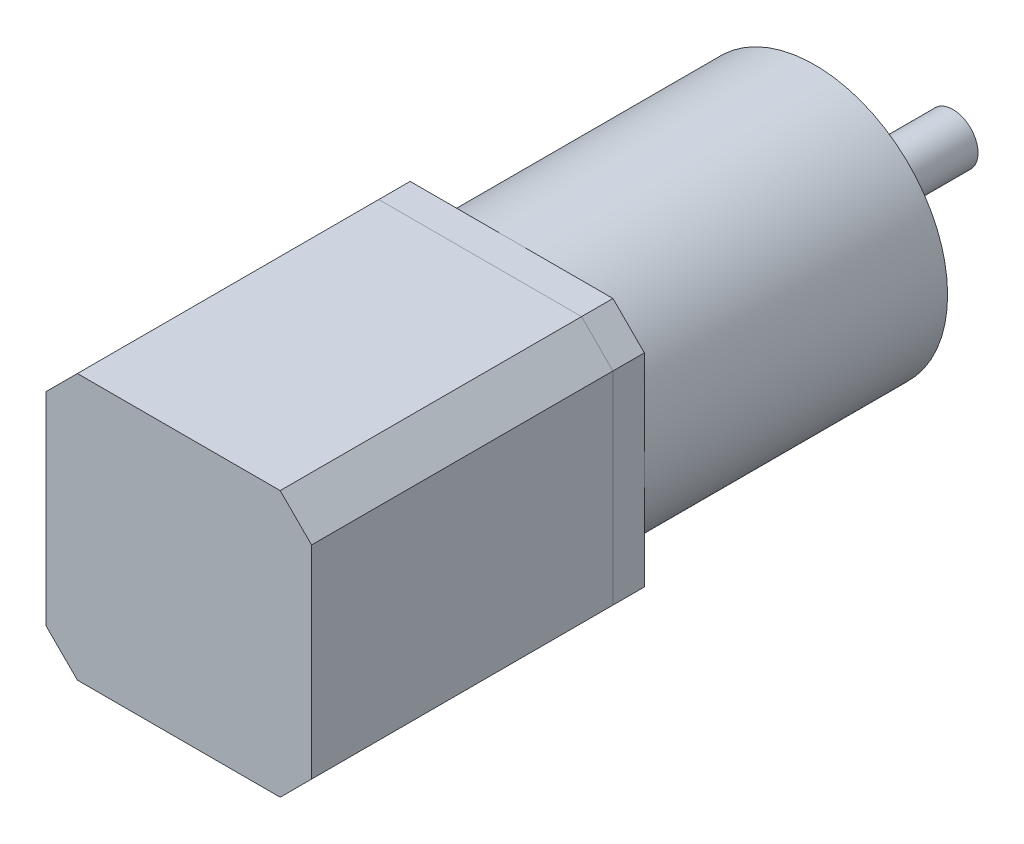
ISO-10303-21;
HEADER;
FILE_DESCRIPTION(('STEP AP214'),'2;1');
FILE_NAME('part.step','',(''),(''),'','','');
FILE_SCHEMA(('AUTOMOTIVE_DESIGN { 1 0 10303 214 1 1 1 1 }'));
ENDSEC;
DATA;
#1=APPLICATION_CONTEXT('core data for automotive mechanical design processes');
#2=APPLICATION_PROTOCOL_DEFINITION('international standard','automotive_design',2000,#1);
#3=PRODUCT_CONTEXT('',#1,'mechanical');
#4=PRODUCT('Part','Part','',(#3));
#5=PRODUCT_RELATED_PRODUCT_CATEGORY('part','',(#4));
#6=PRODUCT_DEFINITION_FORMATION('','',#4);
#7=PRODUCT_DEFINITION_CONTEXT('part definition',#1,'design');
#8=PRODUCT_DEFINITION('design','',#6,#7);
#9=PRODUCT_DEFINITION_SHAPE('','',#8);
#10=(LENGTH_UNIT() NAMED_UNIT(*) SI_UNIT(.MILLI.,.METRE.));
#11=(NAMED_UNIT(*) PLANE_ANGLE_UNIT() SI_UNIT($,.RADIAN.));
#12=(NAMED_UNIT(*) SI_UNIT($,.STERADIAN.) SOLID_ANGLE_UNIT());
#13=UNCERTAINTY_MEASURE_WITH_UNIT(LENGTH_MEASURE(1.E-05),#10,'distance_accuracy_value','');
#14=(GEOMETRIC_REPRESENTATION_CONTEXT(3) GLOBAL_UNCERTAINTY_ASSIGNED_CONTEXT((#13)) GLOBAL_UNIT_ASSIGNED_CONTEXT((#10,
#11,#12)) REPRESENTATION_CONTEXT('',''));
#15=CARTESIAN_POINT('',(0.,0.,0.));
#16=DIRECTION('',(0.,0.,1.));
#17=DIRECTION('',(1.,0.,0.));
#18=AXIS2_PLACEMENT_3D('',#15,#16,#17);
#19=CARTESIAN_POINT('',(0.,0.,-55.8));
#20=DIRECTION('',(0.,0.,1.));
#21=DIRECTION('',(1.,0.,0.));
#22=AXIS2_PLACEMENT_3D('',#19,#20,#21);
#23=CYLINDRICAL_SURFACE('',#22,6.21097509165244);
#24=CARTESIAN_POINT('',(0.,0.,-55.8));
#25=DIRECTION('',(0.,0.,-1.));
#26=DIRECTION('',(-1.,0.,0.));
#27=AXIS2_PLACEMENT_3D('',#24,#25,#26);
#28=CIRCLE('',#27,6.21097509165244);
#29=CARTESIAN_POINT('',(-6.21097509165244,0.,-55.8));
#30=VERTEX_POINT('',#29);
#31=EDGE_CURVE('E11',#30,#30,#28,.T.);
#32=ORIENTED_EDGE('',*,*,#31,.F.);
#33=EDGE_LOOP('',(#32));
#34=FACE_BOUND('',#33,.T.);
#35=CARTESIAN_POINT('',(0.,0.,-55.3));
#36=DIRECTION('',(0.,0.,-1.));
#37=DIRECTION('',(-1.,0.,0.));
#38=AXIS2_PLACEMENT_3D('',#35,#36,#37);
#39=CIRCLE('',#38,6.21097509165244);
#40=CARTESIAN_POINT('',(-6.21097509165244,0.,-55.3));
#41=VERTEX_POINT('',#40);
#42=EDGE_CURVE('E44',#41,#41,#39,.T.);
#43=ORIENTED_EDGE('',*,*,#42,.T.);
#44=EDGE_LOOP('',(#43));
#45=FACE_BOUND('',#44,.T.);
#46=ADVANCED_FACE('F41',(#34,#45),#23,.T.);
#47=CARTESIAN_POINT('',(0.,0.,-55.8));
#48=DIRECTION('',(0.,0.,-1.));
#49=DIRECTION('',(-1.,0.,0.));
#50=AXIS2_PLACEMENT_3D('',#47,#48,#49);
#51=PLANE('',#50);
#52=ORIENTED_EDGE('',*,*,#31,.T.);
#53=EDGE_LOOP('',(#52));
#54=FACE_BOUND('',#53,.T.);
#55=ADVANCED_FACE('F56',(#54),#51,.T.);
#56=CARTESIAN_POINT('',(0.,0.,-55.3));
#57=DIRECTION('',(0.,0.,-1.));
#58=DIRECTION('',(-1.,0.,0.));
#59=AXIS2_PLACEMENT_3D('',#56,#57,#58);
#60=PLANE('',#59);
#61=ORIENTED_EDGE('',*,*,#42,.F.);
#62=EDGE_LOOP('',(#61));
#63=FACE_BOUND('',#62,.T.);
#64=ADVANCED_FACE('F54',(#63),#60,.F.);
#65=CLOSED_SHELL('',(#46,#55,#64));
#66=MANIFOLD_SOLID_BREP('B2',#65);
#67=CARTESIAN_POINT('',(0.,0.,-75.3));
#68=DIRECTION('',(0.,0.,1.));
#69=DIRECTION('',(1.,0.,0.));
#70=AXIS2_PLACEMENT_3D('',#67,#68,#69);
#71=CYLINDRICAL_SURFACE('',#70,4.);
#72=CARTESIAN_POINT('',(0.,0.,-75.3));
#73=DIRECTION('',(0.,0.,-1.));
#74=DIRECTION('',(-1.,0.,0.));
#75=AXIS2_PLACEMENT_3D('',#72,#73,#74);
#76=CIRCLE('',#75,4.);
#77=CARTESIAN_POINT('',(-4.,0.,-75.3));
#78=VERTEX_POINT('',#77);
#79=EDGE_CURVE('E40',#78,#78,#76,.T.);
#80=ORIENTED_EDGE('',*,*,#79,.F.);
#81=EDGE_LOOP('',(#80));
#82=FACE_BOUND('',#81,.T.);
#83=CARTESIAN_POINT('',(0.,0.,-55.3));
#84=DIRECTION('',(0.,0.,-1.));
#85=DIRECTION('',(-1.,0.,0.));
#86=AXIS2_PLACEMENT_3D('',#83,#84,#85);
#87=CIRCLE('',#86,4.);
#88=CARTESIAN_POINT('',(-4.,0.,-55.3));
#89=VERTEX_POINT('',#88);
#90=EDGE_CURVE('E92',#89,#89,#87,.T.);
#91=ORIENTED_EDGE('',*,*,#90,.T.);
#92=EDGE_LOOP('',(#91));
#93=FACE_BOUND('',#92,.T.);
#94=ADVANCED_FACE('F89',(#82,#93),#71,.T.);
#95=CARTESIAN_POINT('',(0.,0.,-75.3));
#96=DIRECTION('',(0.,0.,-1.));
#97=DIRECTION('',(-1.,0.,0.));
#98=AXIS2_PLACEMENT_3D('',#95,#96,#97);
#99=PLANE('',#98);
#100=ORIENTED_EDGE('',*,*,#79,.T.);
#101=EDGE_LOOP('',(#100));
#102=FACE_BOUND('',#101,.T.);
#103=ADVANCED_FACE('F104',(#102),#99,.T.);
#104=CARTESIAN_POINT('',(0.,0.,-55.3));
#105=DIRECTION('',(0.,0.,-1.));
#106=DIRECTION('',(-1.,0.,0.));
#107=AXIS2_PLACEMENT_3D('',#104,#105,#106);
#108=PLANE('',#107);
#109=ORIENTED_EDGE('',*,*,#90,.F.);
#110=EDGE_LOOP('',(#109));
#111=FACE_BOUND('',#110,.T.);
#112=ADVANCED_FACE('F102',(#111),#108,.F.);
#113=CLOSED_SHELL('',(#94,#103,#112));
#114=MANIFOLD_SOLID_BREP('B6',#113);
#115=CARTESIAN_POINT('',(0.,0.,-55.3));
#116=DIRECTION('',(0.,0.,1.));
#117=DIRECTION('',(1.,0.,0.));
#118=AXIS2_PLACEMENT_3D('',#115,#116,#117);
#119=CYLINDRICAL_SURFACE('',#118,11.);
#120=CARTESIAN_POINT('',(0.,0.,-55.3));
#121=DIRECTION('',(0.,0.,-1.));
#122=DIRECTION('',(-1.,0.,0.));
#123=AXIS2_PLACEMENT_3D('',#120,#121,#122);
#124=CIRCLE('',#123,11.);
#125=CARTESIAN_POINT('',(-11.,0.,-55.3));
#126=VERTEX_POINT('',#125);
#127=EDGE_CURVE('E88',#126,#126,#124,.T.);
#128=ORIENTED_EDGE('',*,*,#127,.F.);
#129=EDGE_LOOP('',(#128));
#130=FACE_BOUND('',#129,.T.);
#131=CARTESIAN_POINT('',(0.,0.,-53.3));
#132=DIRECTION('',(0.,0.,-1.));
#133=DIRECTION('',(-1.,0.,0.));
#134=AXIS2_PLACEMENT_3D('',#131,#132,#133);
#135=CIRCLE('',#134,11.);
#136=CARTESIAN_POINT('',(-11.,0.,-53.3));
#137=VERTEX_POINT('',#136);
#138=EDGE_CURVE('E140',#137,#137,#135,.T.);
#139=ORIENTED_EDGE('',*,*,#138,.T.);
#140=EDGE_LOOP('',(#139));
#141=FACE_BOUND('',#140,.T.);
#142=ADVANCED_FACE('F137',(#130,#141),#119,.T.);
#143=CARTESIAN_POINT('',(0.,0.,-55.3));
#144=DIRECTION('',(0.,0.,-1.));
#145=DIRECTION('',(-1.,0.,0.));
#146=AXIS2_PLACEMENT_3D('',#143,#144,#145);
#147=PLANE('',#146);
#148=ORIENTED_EDGE('',*,*,#127,.T.);
#149=EDGE_LOOP('',(#148));
#150=FACE_BOUND('',#149,.T.);
#151=ADVANCED_FACE('F152',(#150),#147,.T.);
#152=CARTESIAN_POINT('',(0.,0.,-53.3));
#153=DIRECTION('',(0.,0.,-1.));
#154=DIRECTION('',(-1.,0.,0.));
#155=AXIS2_PLACEMENT_3D('',#152,#153,#154);
#156=PLANE('',#155);
#157=ORIENTED_EDGE('',*,*,#138,.F.);
#158=EDGE_LOOP('',(#157));
#159=FACE_BOUND('',#158,.T.);
#160=ADVANCED_FACE('F150',(#159),#156,.F.);
#161=CLOSED_SHELL('',(#142,#151,#160));
#162=MANIFOLD_SOLID_BREP('B35',#161);
#163=CARTESIAN_POINT('',(0.,0.,-53.3));
#164=DIRECTION('',(0.,0.,1.));
#165=DIRECTION('',(1.,0.,0.));
#166=AXIS2_PLACEMENT_3D('',#163,#164,#165);
#167=CYLINDRICAL_SURFACE('',#166,21.15);
#168=CARTESIAN_POINT('',(0.,0.,-53.3));
#169=DIRECTION('',(0.,0.,-1.));
#170=DIRECTION('',(-1.,0.,0.));
#171=AXIS2_PLACEMENT_3D('',#168,#169,#170);
#172=CIRCLE('',#171,21.15);
#173=CARTESIAN_POINT('',(-21.15,0.,-53.3));
#174=VERTEX_POINT('',#173);
#175=EDGE_CURVE('E136',#174,#174,#172,.T.);
#176=ORIENTED_EDGE('',*,*,#175,.F.);
#177=EDGE_LOOP('',(#176));
#178=FACE_BOUND('',#177,.T.);
#179=CARTESIAN_POINT('',(0.,0.,-5.));
#180=DIRECTION('',(0.,0.,-1.));
#181=DIRECTION('',(-1.,0.,0.));
#182=AXIS2_PLACEMENT_3D('',#179,#180,#181);
#183=CIRCLE('',#182,21.15);
#184=CARTESIAN_POINT('',(-21.15,0.,-5.));
#185=VERTEX_POINT('',#184);
#186=EDGE_CURVE('E190',#185,#185,#183,.T.);
#187=ORIENTED_EDGE('',*,*,#186,.T.);
#188=EDGE_LOOP('',(#187));
#189=FACE_BOUND('',#188,.T.);
#190=ADVANCED_FACE('F187',(#178,#189),#167,.T.);
#191=CARTESIAN_POINT('',(0.,0.,-53.3));
#192=DIRECTION('',(0.,0.,-1.));
#193=DIRECTION('',(-1.,0.,0.));
#194=AXIS2_PLACEMENT_3D('',#191,#192,#193);
#195=PLANE('',#194);
#196=CARTESIAN_POINT('',(17.5,0.,-53.3));
#197=DIRECTION('',(0.,0.,-1.));
#198=DIRECTION('',(-1.,0.,0.));
#199=AXIS2_PLACEMENT_3D('',#196,#197,#198);
#200=CIRCLE('',#199,1.5);
#201=CARTESIAN_POINT('',(16.,0.,-53.3));
#202=VERTEX_POINT('',#201);
#203=EDGE_CURVE('E217',#202,#202,#200,.T.);
#204=ORIENTED_EDGE('',*,*,#203,.F.);
#205=EDGE_LOOP('',(#204));
#206=FACE_BOUND('',#205,.T.);
#207=CARTESIAN_POINT('',(0.,17.5,-53.3));
#208=DIRECTION('',(0.,0.,-1.));
#209=DIRECTION('',(-1.,0.,0.));
#210=AXIS2_PLACEMENT_3D('',#207,#208,#209);
#211=CIRCLE('',#210,1.5);
#212=CARTESIAN_POINT('',(-1.50000000000006,17.5,-53.3));
#213=VERTEX_POINT('',#212);
#214=EDGE_CURVE('E211',#213,#213,#211,.T.);
#215=ORIENTED_EDGE('',*,*,#214,.F.);
#216=EDGE_LOOP('',(#215));
#217=FACE_BOUND('',#216,.T.);
#218=CARTESIAN_POINT('',(-17.5,-1.2220184685951E-13,-53.3));
#219=DIRECTION('',(0.,0.,-1.));
#220=DIRECTION('',(-1.,0.,0.));
#221=AXIS2_PLACEMENT_3D('',#218,#219,#220);
#222=CIRCLE('',#221,1.5);
#223=CARTESIAN_POINT('',(-19.,-1.2220184685951E-13,-53.3));
#224=VERTEX_POINT('',#223);
#225=EDGE_CURVE('E205',#224,#224,#222,.T.);
#226=ORIENTED_EDGE('',*,*,#225,.F.);
#227=EDGE_LOOP('',(#226));
#228=FACE_BOUND('',#227,.T.);
#229=CARTESIAN_POINT('',(1.83302770289265E-13,-17.5,-53.3));
#230=DIRECTION('',(0.,0.,-1.));
#231=DIRECTION('',(-1.,0.,0.));
#232=AXIS2_PLACEMENT_3D('',#229,#230,#231);
#233=CIRCLE('',#232,1.5);
#234=CARTESIAN_POINT('',(-1.49999999999982,-17.5,-53.3));
#235=VERTEX_POINT('',#234);
#236=EDGE_CURVE('E199',#235,#235,#233,.T.);
#237=ORIENTED_EDGE('',*,*,#236,.F.);
#238=EDGE_LOOP('',(#237));
#239=FACE_BOUND('',#238,.T.);
#240=ORIENTED_EDGE('',*,*,#175,.T.);
#241=EDGE_LOOP('',(#240));
#242=FACE_BOUND('',#241,.T.);
#243=ADVANCED_FACE('F232',(#206,#217,#228,#239,#242),#195,.T.);
#244=CARTESIAN_POINT('',(0.,0.,-5.));
#245=DIRECTION('',(0.,0.,-1.));
#246=DIRECTION('',(-1.,0.,0.));
#247=AXIS2_PLACEMENT_3D('',#244,#245,#246);
#248=PLANE('',#247);
#249=ORIENTED_EDGE('',*,*,#186,.F.);
#250=EDGE_LOOP('',(#249));
#251=FACE_BOUND('',#250,.T.);
#252=ADVANCED_FACE('F235',(#251),#248,.F.);
#253=CARTESIAN_POINT('',(1.83302770289265E-13,-17.5,-43.3));
#254=DIRECTION('',(0.,0.,-1.));
#255=DIRECTION('',(-1.,0.,0.));
#256=AXIS2_PLACEMENT_3D('',#253,#254,#255);
#257=CYLINDRICAL_SURFACE('',#256,1.5);
#258=CARTESIAN_POINT('',(1.83302770289265E-13,-17.5,-43.3));
#259=DIRECTION('',(0.,0.,-1.));
#260=DIRECTION('',(-1.,0.,0.));
#261=AXIS2_PLACEMENT_3D('',#258,#259,#260);
#262=CIRCLE('',#261,1.5);
#263=CARTESIAN_POINT('',(-1.49999999999982,-17.5,-43.3));
#264=VERTEX_POINT('',#263);
#265=EDGE_CURVE('E202',#264,#264,#262,.T.);
#266=ORIENTED_EDGE('',*,*,#265,.F.);
#267=EDGE_LOOP('',(#266));
#268=FACE_BOUND('',#267,.T.);
#269=ORIENTED_EDGE('',*,*,#236,.T.);
#270=EDGE_LOOP('',(#269));
#271=FACE_BOUND('',#270,.T.);
#272=ADVANCED_FACE('F243',(#268,#271),#257,.F.);
#273=CARTESIAN_POINT('',(1.83302770289265E-13,-17.5,-43.3));
#274=DIRECTION('',(0.,0.,-1.));
#275=DIRECTION('',(-1.,0.,0.));
#276=AXIS2_PLACEMENT_3D('',#273,#274,#275);
#277=PLANE('',#276);
#278=ORIENTED_EDGE('',*,*,#265,.T.);
#279=EDGE_LOOP('',(#278));
#280=FACE_BOUND('',#279,.T.);
#281=ADVANCED_FACE('F245',(#280),#277,.T.);
#282=CARTESIAN_POINT('',(-17.5,-1.2220184685951E-13,-43.3));
#283=DIRECTION('',(0.,0.,-1.));
#284=DIRECTION('',(-1.,0.,0.));
#285=AXIS2_PLACEMENT_3D('',#282,#283,#284);
#286=CYLINDRICAL_SURFACE('',#285,1.5);
#287=CARTESIAN_POINT('',(-17.5,-1.2220184685951E-13,-43.3));
#288=DIRECTION('',(0.,0.,-1.));
#289=DIRECTION('',(-1.,0.,0.));
#290=AXIS2_PLACEMENT_3D('',#287,#288,#289);
#291=CIRCLE('',#290,1.5);
#292=CARTESIAN_POINT('',(-19.,-1.2220184685951E-13,-43.3));
#293=VERTEX_POINT('',#292);
#294=EDGE_CURVE('E208',#293,#293,#291,.T.);
#295=ORIENTED_EDGE('',*,*,#294,.F.);
#296=EDGE_LOOP('',(#295));
#297=FACE_BOUND('',#296,.T.);
#298=ORIENTED_EDGE('',*,*,#225,.T.);
#299=EDGE_LOOP('',(#298));
#300=FACE_BOUND('',#299,.T.);
#301=ADVANCED_FACE('F252',(#297,#300),#286,.F.);
#302=CARTESIAN_POINT('',(-17.5,-1.2220184685951E-13,-43.3));
#303=DIRECTION('',(0.,0.,-1.));
#304=DIRECTION('',(-1.,0.,0.));
#305=AXIS2_PLACEMENT_3D('',#302,#303,#304);
#306=PLANE('',#305);
#307=ORIENTED_EDGE('',*,*,#294,.T.);
#308=EDGE_LOOP('',(#307));
#309=FACE_BOUND('',#308,.T.);
#310=ADVANCED_FACE('F292',(#309),#306,.T.);
#311=CARTESIAN_POINT('',(0.,17.5,-43.3));
#312=DIRECTION('',(0.,0.,-1.));
#313=DIRECTION('',(-1.,0.,0.));
#314=AXIS2_PLACEMENT_3D('',#311,#312,#313);
#315=CYLINDRICAL_SURFACE('',#314,1.5);
#316=CARTESIAN_POINT('',(0.,17.5,-43.3));
#317=DIRECTION('',(0.,0.,-1.));
#318=DIRECTION('',(-1.,0.,0.));
#319=AXIS2_PLACEMENT_3D('',#316,#317,#318);
#320=CIRCLE('',#319,1.5);
#321=CARTESIAN_POINT('',(-1.50000000000006,17.5,-43.3));
#322=VERTEX_POINT('',#321);
#323=EDGE_CURVE('E214',#322,#322,#320,.T.);
#324=ORIENTED_EDGE('',*,*,#323,.F.);
#325=EDGE_LOOP('',(#324));
#326=FACE_BOUND('',#325,.T.);
#327=ORIENTED_EDGE('',*,*,#214,.T.);
#328=EDGE_LOOP('',(#327));
#329=FACE_BOUND('',#328,.T.);
#330=ADVANCED_FACE('F301',(#326,#329),#315,.F.);
#331=CARTESIAN_POINT('',(0.,17.5,-43.3));
#332=DIRECTION('',(0.,0.,-1.));
#333=DIRECTION('',(-1.,0.,0.));
#334=AXIS2_PLACEMENT_3D('',#331,#332,#333);
#335=PLANE('',#334);
#336=ORIENTED_EDGE('',*,*,#323,.T.);
#337=EDGE_LOOP('',(#336));
#338=FACE_BOUND('',#337,.T.);
#339=ADVANCED_FACE('F228',(#338),#335,.T.);
#340=CARTESIAN_POINT('',(17.5,0.,-43.3));
#341=DIRECTION('',(0.,0.,-1.));
#342=DIRECTION('',(-1.,0.,0.));
#343=AXIS2_PLACEMENT_3D('',#340,#341,#342);
#344=CYLINDRICAL_SURFACE('',#343,1.5);
#345=CARTESIAN_POINT('',(17.5,0.,-43.3));
#346=DIRECTION('',(0.,0.,-1.));
#347=DIRECTION('',(-1.,0.,0.));
#348=AXIS2_PLACEMENT_3D('',#345,#346,#347);
#349=CIRCLE('',#348,1.5);
#350=CARTESIAN_POINT('',(16.,0.,-43.3));
#351=VERTEX_POINT('',#350);
#352=EDGE_CURVE('E197',#351,#351,#349,.T.);
#353=ORIENTED_EDGE('',*,*,#352,.F.);
#354=EDGE_LOOP('',(#353));
#355=FACE_BOUND('',#354,.T.);
#356=ORIENTED_EDGE('',*,*,#203,.T.);
#357=EDGE_LOOP('',(#356));
#358=FACE_BOUND('',#357,.T.);
#359=ADVANCED_FACE('F225',(#355,#358),#344,.F.);
#360=CARTESIAN_POINT('',(17.5,0.,-43.3));
#361=DIRECTION('',(0.,0.,-1.));
#362=DIRECTION('',(-1.,0.,0.));
#363=AXIS2_PLACEMENT_3D('',#360,#361,#362);
#364=PLANE('',#363);
#365=ORIENTED_EDGE('',*,*,#352,.T.);
#366=EDGE_LOOP('',(#365));
#367=FACE_BOUND('',#366,.T.);
#368=ADVANCED_FACE('F223',(#367),#364,.T.);
#369=CLOSED_SHELL('',(#190,#243,#252,#272,#281,#301,#310,#330,#339,#359,#368));
#370=MANIFOLD_SOLID_BREP('B83',#369);
#371=CARTESIAN_POINT('',(-21.15,-21.15,-5.));
#372=DIRECTION('',(1.,0.,0.));
#373=DIRECTION('',(0.,0.,-1.));
#374=AXIS2_PLACEMENT_3D('',#371,#372,#373);
#375=PLANE('',#374);
#376=DIRECTION('',(0.,1.,0.));
#377=VECTOR('',#376,1.);
#378=CARTESIAN_POINT('',(-21.15,-21.15,-5.));
#379=LINE('',#378,#377);
#380=CARTESIAN_POINT('',(-21.15,-16.15,-5.));
#381=VERTEX_POINT('',#380);
#382=CARTESIAN_POINT('',(-21.15,16.15,-5.));
#383=VERTEX_POINT('',#382);
#384=EDGE_CURVE('E447',#381,#383,#379,.T.);
#385=ORIENTED_EDGE('',*,*,#384,.F.);
#386=DIRECTION('',(0.,0.,1.));
#387=VECTOR('',#386,1.);
#388=CARTESIAN_POINT('',(-21.15,-16.15,-5.));
#389=LINE('',#388,#387);
#390=CARTESIAN_POINT('',(-21.15,-16.15,0.));
#391=VERTEX_POINT('',#390);
#392=EDGE_CURVE('E473',#381,#391,#389,.T.);
#393=ORIENTED_EDGE('',*,*,#392,.T.);
#394=DIRECTION('',(0.,1.,0.));
#395=VECTOR('',#394,1.);
#396=CARTESIAN_POINT('',(-21.15,-21.15,0.));
#397=LINE('',#396,#395);
#398=CARTESIAN_POINT('',(-21.15,16.15,0.));
#399=VERTEX_POINT('',#398);
#400=EDGE_CURVE('E481',#391,#399,#397,.T.);
#401=ORIENTED_EDGE('',*,*,#400,.T.);
#402=DIRECTION('',(0.,0.,-1.));
#403=VECTOR('',#402,1.);
#404=CARTESIAN_POINT('',(-21.15,16.15,-5.));
#405=LINE('',#404,#403);
#406=EDGE_CURVE('E471',#399,#383,#405,.T.);
#407=ORIENTED_EDGE('',*,*,#406,.T.);
#408=EDGE_LOOP('',(#385,#393,#401,#407));
#409=FACE_BOUND('',#408,.T.);
#410=ADVANCED_FACE('F356',(#409),#375,.F.);
#411=CARTESIAN_POINT('',(21.15,21.15,-5.));
#412=DIRECTION('',(0.,-1.,0.));
#413=DIRECTION('',(0.,0.,-1.));
#414=AXIS2_PLACEMENT_3D('',#411,#412,#413);
#415=PLANE('',#414);
#416=DIRECTION('',(1.,0.,0.));
#417=VECTOR('',#416,1.);
#418=CARTESIAN_POINT('',(21.15,21.15,0.));
#419=LINE('',#418,#417);
#420=CARTESIAN_POINT('',(-16.15,21.15,0.));
#421=VERTEX_POINT('',#420);
#422=CARTESIAN_POINT('',(16.15,21.15,0.));
#423=VERTEX_POINT('',#422);
#424=EDGE_CURVE('E452',#421,#423,#419,.T.);
#425=ORIENTED_EDGE('',*,*,#424,.T.);
#426=DIRECTION('',(0.,0.,-1.));
#427=VECTOR('',#426,1.);
#428=CARTESIAN_POINT('',(16.15,21.15,-5.));
#429=LINE('',#428,#427);
#430=CARTESIAN_POINT('',(16.15,21.15,-5.));
#431=VERTEX_POINT('',#430);
#432=EDGE_CURVE('E185',#423,#431,#429,.T.);
#433=ORIENTED_EDGE('',*,*,#432,.T.);
#434=DIRECTION('',(1.,0.,0.));
#435=VECTOR('',#434,1.);
#436=CARTESIAN_POINT('',(21.15,21.15,-5.));
#437=LINE('',#436,#435);
#438=CARTESIAN_POINT('',(-16.15,21.15,-5.));
#439=VERTEX_POINT('',#438);
#440=EDGE_CURVE('E450',#439,#431,#437,.T.);
#441=ORIENTED_EDGE('',*,*,#440,.F.);
#442=DIRECTION('',(0.,0.,1.));
#443=VECTOR('',#442,1.);
#444=CARTESIAN_POINT('',(-16.15,21.15,-5.));
#445=LINE('',#444,#443);
#446=EDGE_CURVE('E364',#439,#421,#445,.T.);
#447=ORIENTED_EDGE('',*,*,#446,.T.);
#448=EDGE_LOOP('',(#425,#433,#441,#447));
#449=FACE_BOUND('',#448,.T.);
#450=ADVANCED_FACE('F478',(#449),#415,.F.);
#451=CARTESIAN_POINT('',(21.15,-21.15,-5.));
#452=DIRECTION('',(-1.,0.,0.));
#453=DIRECTION('',(0.,0.,1.));
#454=AXIS2_PLACEMENT_3D('',#451,#452,#453);
#455=PLANE('',#454);
#456=DIRECTION('',(0.,-1.,0.));
#457=VECTOR('',#456,1.);
#458=CARTESIAN_POINT('',(21.15,-21.15,0.));
#459=LINE('',#458,#457);
#460=CARTESIAN_POINT('',(21.15,16.15,0.));
#461=VERTEX_POINT('',#460);
#462=CARTESIAN_POINT('',(21.15,-16.15,0.));
#463=VERTEX_POINT('',#462);
#464=EDGE_CURVE('E448',#461,#463,#459,.T.);
#465=ORIENTED_EDGE('',*,*,#464,.T.);
#466=DIRECTION('',(0.,0.,-1.));
#467=VECTOR('',#466,1.);
#468=CARTESIAN_POINT('',(21.15,-16.15,-5.));
#469=LINE('',#468,#467);
#470=CARTESIAN_POINT('',(21.15,-16.15,-5.));
#471=VERTEX_POINT('',#470);
#472=EDGE_CURVE('E426',#463,#471,#469,.T.);
#473=ORIENTED_EDGE('',*,*,#472,.T.);
#474=DIRECTION('',(0.,-1.,0.));
#475=VECTOR('',#474,1.);
#476=CARTESIAN_POINT('',(21.15,-21.15,-5.));
#477=LINE('',#476,#475);
#478=CARTESIAN_POINT('',(21.15,16.15,-5.));
#479=VERTEX_POINT('',#478);
#480=EDGE_CURVE('E485',#479,#471,#477,.T.);
#481=ORIENTED_EDGE('',*,*,#480,.F.);
#482=DIRECTION('',(0.,0.,1.));
#483=VECTOR('',#482,1.);
#484=CARTESIAN_POINT('',(21.15,16.15,-5.));
#485=LINE('',#484,#483);
#486=EDGE_CURVE('E431',#479,#461,#485,.T.);
#487=ORIENTED_EDGE('',*,*,#486,.T.);
#488=EDGE_LOOP('',(#465,#473,#481,#487));
#489=FACE_BOUND('',#488,.T.);
#490=ADVANCED_FACE('F495',(#489),#455,.F.);
#491=CARTESIAN_POINT('',(21.15,-21.15,-5.));
#492=DIRECTION('',(0.,1.,0.));
#493=DIRECTION('',(0.,0.,1.));
#494=AXIS2_PLACEMENT_3D('',#491,#492,#493);
#495=PLANE('',#494);
#496=DIRECTION('',(-1.,0.,0.));
#497=VECTOR('',#496,1.);
#498=CARTESIAN_POINT('',(21.15,-21.15,-5.));
#499=LINE('',#498,#497);
#500=CARTESIAN_POINT('',(16.15,-21.15,-5.));
#501=VERTEX_POINT('',#500);
#502=CARTESIAN_POINT('',(-16.15,-21.15,-5.));
#503=VERTEX_POINT('',#502);
#504=EDGE_CURVE('E441',#501,#503,#499,.T.);
#505=ORIENTED_EDGE('',*,*,#504,.F.);
#506=DIRECTION('',(0.,0.,1.));
#507=VECTOR('',#506,1.);
#508=CARTESIAN_POINT('',(16.15,-21.15,-5.));
#509=LINE('',#508,#507);
#510=CARTESIAN_POINT('',(16.15,-21.15,0.));
#511=VERTEX_POINT('',#510);
#512=EDGE_CURVE('E425',#501,#511,#509,.T.);
#513=ORIENTED_EDGE('',*,*,#512,.T.);
#514=DIRECTION('',(-1.,0.,0.));
#515=VECTOR('',#514,1.);
#516=CARTESIAN_POINT('',(21.15,-21.15,0.));
#517=LINE('',#516,#515);
#518=CARTESIAN_POINT('',(-16.15,-21.15,0.));
#519=VERTEX_POINT('',#518);
#520=EDGE_CURVE('E438',#511,#519,#517,.T.);
#521=ORIENTED_EDGE('',*,*,#520,.T.);
#522=DIRECTION('',(0.,0.,-1.));
#523=VECTOR('',#522,1.);
#524=CARTESIAN_POINT('',(-16.15,-21.15,-5.));
#525=LINE('',#524,#523);
#526=EDGE_CURVE('E443',#519,#503,#525,.T.);
#527=ORIENTED_EDGE('',*,*,#526,.T.);
#528=EDGE_LOOP('',(#505,#513,#521,#527));
#529=FACE_BOUND('',#528,.T.);
#530=ADVANCED_FACE('F437',(#529),#495,.F.);
#531=CARTESIAN_POINT('',(0.,0.,-5.));
#532=DIRECTION('',(0.,0.,1.));
#533=DIRECTION('',(1.,0.,0.));
#534=AXIS2_PLACEMENT_3D('',#531,#532,#533);
#535=PLANE('',#534);
#536=ORIENTED_EDGE('',*,*,#480,.T.);
#537=DIRECTION('',(0.707106781186546,0.707106781186549,0.));
#538=VECTOR('',#537,1.);
#539=CARTESIAN_POINT('',(16.15,-21.15,-5.));
#540=LINE('',#539,#538);
#541=EDGE_CURVE('E469',#471,#501,#540,.F.);
#542=ORIENTED_EDGE('',*,*,#541,.T.);
#543=ORIENTED_EDGE('',*,*,#504,.T.);
#544=DIRECTION('',(0.707106781186549,-0.707106781186546,0.));
#545=VECTOR('',#544,1.);
#546=CARTESIAN_POINT('',(-21.15,-16.15,-5.));
#547=LINE('',#546,#545);
#548=EDGE_CURVE('E467',#503,#381,#547,.F.);
#549=ORIENTED_EDGE('',*,*,#548,.T.);
#550=ORIENTED_EDGE('',*,*,#384,.T.);
#551=DIRECTION('',(-0.707106781186546,-0.707106781186549,0.));
#552=VECTOR('',#551,1.);
#553=CARTESIAN_POINT('',(-16.15,21.15,-5.));
#554=LINE('',#553,#552);
#555=EDGE_CURVE('E376',#383,#439,#554,.F.);
#556=ORIENTED_EDGE('',*,*,#555,.T.);
#557=ORIENTED_EDGE('',*,*,#440,.T.);
#558=DIRECTION('',(-0.707106781186549,0.707106781186546,0.));
#559=VECTOR('',#558,1.);
#560=CARTESIAN_POINT('',(21.15,16.15,-5.));
#561=LINE('',#560,#559);
#562=EDGE_CURVE('E465',#431,#479,#561,.F.);
#563=ORIENTED_EDGE('',*,*,#562,.T.);
#564=EDGE_LOOP('',(#536,#542,#543,#549,#550,#556,#557,#563));
#565=FACE_BOUND('',#564,.T.);
#566=ADVANCED_FACE('F489',(#565),#535,.F.);
#567=CARTESIAN_POINT('',(0.,0.,0.));
#568=DIRECTION('',(0.,0.,1.));
#569=DIRECTION('',(1.,0.,0.));
#570=AXIS2_PLACEMENT_3D('',#567,#568,#569);
#571=PLANE('',#570);
#572=ORIENTED_EDGE('',*,*,#520,.F.);
#573=DIRECTION('',(-0.707106781186546,-0.707106781186549,0.));
#574=VECTOR('',#573,1.);
#575=CARTESIAN_POINT('',(18.65,-18.65,0.));
#576=LINE('',#575,#574);
#577=EDGE_CURVE('E421',#511,#463,#576,.F.);
#578=ORIENTED_EDGE('',*,*,#577,.T.);
#579=ORIENTED_EDGE('',*,*,#464,.F.);
#580=DIRECTION('',(0.707106781186549,-0.707106781186546,0.));
#581=VECTOR('',#580,1.);
#582=CARTESIAN_POINT('',(18.65,18.65,0.));
#583=LINE('',#582,#581);
#584=EDGE_CURVE('E458',#461,#423,#583,.F.);
#585=ORIENTED_EDGE('',*,*,#584,.T.);
#586=ORIENTED_EDGE('',*,*,#424,.F.);
#587=DIRECTION('',(0.707106781186546,0.707106781186549,0.));
#588=VECTOR('',#587,1.);
#589=CARTESIAN_POINT('',(-18.65,18.65,0.));
#590=LINE('',#589,#588);
#591=EDGE_CURVE('E442',#421,#399,#590,.F.);
#592=ORIENTED_EDGE('',*,*,#591,.T.);
#593=ORIENTED_EDGE('',*,*,#400,.F.);
#594=DIRECTION('',(-0.707106781186549,0.707106781186546,0.));
#595=VECTOR('',#594,1.);
#596=CARTESIAN_POINT('',(-18.65,-18.65,0.));
#597=LINE('',#596,#595);
#598=EDGE_CURVE('E432',#391,#519,#597,.F.);
#599=ORIENTED_EDGE('',*,*,#598,.T.);
#600=EDGE_LOOP('',(#572,#578,#579,#585,#586,#592,#593,#599));
#601=FACE_BOUND('',#600,.T.);
#602=ADVANCED_FACE('F445',(#601),#571,.T.);
#603=CARTESIAN_POINT('',(16.15,-21.15,-5.));
#604=DIRECTION('',(-0.707106781186549,0.707106781186546,0.));
#605=DIRECTION('',(0.,0.,1.));
#606=AXIS2_PLACEMENT_3D('',#603,#604,#605);
#607=PLANE('',#606);
#608=ORIENTED_EDGE('',*,*,#541,.F.);
#609=ORIENTED_EDGE('',*,*,#472,.F.);
#610=ORIENTED_EDGE('',*,*,#577,.F.);
#611=ORIENTED_EDGE('',*,*,#512,.F.);
#612=EDGE_LOOP('',(#608,#609,#610,#611));
#613=FACE_BOUND('',#612,.T.);
#614=ADVANCED_FACE('F424',(#613),#607,.F.);
#615=CARTESIAN_POINT('',(-21.15,-16.15,-5.));
#616=DIRECTION('',(0.707106781186546,0.707106781186549,0.));
#617=DIRECTION('',(0.,0.,1.));
#618=AXIS2_PLACEMENT_3D('',#615,#616,#617);
#619=PLANE('',#618);
#620=ORIENTED_EDGE('',*,*,#548,.F.);
#621=ORIENTED_EDGE('',*,*,#526,.F.);
#622=ORIENTED_EDGE('',*,*,#598,.F.);
#623=ORIENTED_EDGE('',*,*,#392,.F.);
#624=EDGE_LOOP('',(#620,#621,#622,#623));
#625=FACE_BOUND('',#624,.T.);
#626=ADVANCED_FACE('F500',(#625),#619,.F.);
#627=CARTESIAN_POINT('',(21.15,16.15,-5.));
#628=DIRECTION('',(-0.707106781186546,-0.707106781186549,0.));
#629=DIRECTION('',(0.,0.,1.));
#630=AXIS2_PLACEMENT_3D('',#627,#628,#629);
#631=PLANE('',#630);
#632=ORIENTED_EDGE('',*,*,#562,.F.);
#633=ORIENTED_EDGE('',*,*,#432,.F.);
#634=ORIENTED_EDGE('',*,*,#584,.F.);
#635=ORIENTED_EDGE('',*,*,#486,.F.);
#636=EDGE_LOOP('',(#632,#633,#634,#635));
#637=FACE_BOUND('',#636,.T.);
#638=ADVANCED_FACE('F493',(#637),#631,.F.);
#639=CARTESIAN_POINT('',(-16.15,21.15,-5.));
#640=DIRECTION('',(0.707106781186549,-0.707106781186546,0.));
#641=DIRECTION('',(0.,0.,1.));
#642=AXIS2_PLACEMENT_3D('',#639,#640,#641);
#643=PLANE('',#642);
#644=ORIENTED_EDGE('',*,*,#555,.F.);
#645=ORIENTED_EDGE('',*,*,#406,.F.);
#646=ORIENTED_EDGE('',*,*,#591,.F.);
#647=ORIENTED_EDGE('',*,*,#446,.F.);
#648=EDGE_LOOP('',(#644,#645,#646,#647));
#649=FACE_BOUND('',#648,.T.);
#650=ADVANCED_FACE('F358',(#649),#643,.F.);
#651=CLOSED_SHELL('',(#410,#450,#490,#530,#566,#602,#614,#626,#638,#650));
#652=MANIFOLD_SOLID_BREP('B131',#651);
#653=CARTESIAN_POINT('',(21.15,21.15,48.));
#654=DIRECTION('',(-1.,0.,0.));
#655=DIRECTION('',(0.,-1.,0.));
#656=AXIS2_PLACEMENT_3D('',#653,#654,#655);
#657=PLANE('',#656);
#658=DIRECTION('',(0.,1.,0.));
#659=VECTOR('',#658,1.);
#660=CARTESIAN_POINT('',(21.15,21.15,48.));
#661=LINE('',#660,#659);
#662=CARTESIAN_POINT('',(21.15,-16.15,48.));
#663=VERTEX_POINT('',#662);
#664=CARTESIAN_POINT('',(21.15,16.15,48.));
#665=VERTEX_POINT('',#664);
#666=EDGE_CURVE('E674',#663,#665,#661,.T.);
#667=ORIENTED_EDGE('',*,*,#666,.F.);
#668=DIRECTION('',(0.,0.,-1.));
#669=VECTOR('',#668,1.);
#670=CARTESIAN_POINT('',(21.15,-16.15,48.));
#671=LINE('',#670,#669);
#672=CARTESIAN_POINT('',(21.15,-16.15,0.));
#673=VERTEX_POINT('',#672);
#674=EDGE_CURVE('E700',#663,#673,#671,.T.);
#675=ORIENTED_EDGE('',*,*,#674,.T.);
#676=DIRECTION('',(0.,1.,0.));
#677=VECTOR('',#676,1.);
#678=CARTESIAN_POINT('',(21.15,21.15,0.));
#679=LINE('',#678,#677);
#680=CARTESIAN_POINT('',(21.15,16.15,0.));
#681=VERTEX_POINT('',#680);
#682=EDGE_CURVE('E708',#673,#681,#679,.T.);
#683=ORIENTED_EDGE('',*,*,#682,.T.);
#684=DIRECTION('',(0.,0.,1.));
#685=VECTOR('',#684,1.);
#686=CARTESIAN_POINT('',(21.15,16.15,48.));
#687=LINE('',#686,#685);
#688=EDGE_CURVE('E698',#681,#665,#687,.T.);
#689=ORIENTED_EDGE('',*,*,#688,.T.);
#690=EDGE_LOOP('',(#667,#675,#683,#689));
#691=FACE_BOUND('',#690,.T.);
#692=ADVANCED_FACE('F583',(#691),#657,.F.);
#693=CARTESIAN_POINT('',(-21.15,21.15,48.));
#694=DIRECTION('',(0.,-1.,0.));
#695=DIRECTION('',(0.,0.,-1.));
#696=AXIS2_PLACEMENT_3D('',#693,#694,#695);
#697=PLANE('',#696);
#698=DIRECTION('',(-1.,0.,0.));
#699=VECTOR('',#698,1.);
#700=CARTESIAN_POINT('',(-21.15,21.15,0.));
#701=LINE('',#700,#699);
#702=CARTESIAN_POINT('',(16.15,21.15,0.));
#703=VERTEX_POINT('',#702);
#704=CARTESIAN_POINT('',(-16.15,21.15,0.));
#705=VERTEX_POINT('',#704);
#706=EDGE_CURVE('E679',#703,#705,#701,.T.);
#707=ORIENTED_EDGE('',*,*,#706,.T.);
#708=DIRECTION('',(0.,0.,1.));
#709=VECTOR('',#708,1.);
#710=CARTESIAN_POINT('',(-16.15,21.15,48.));
#711=LINE('',#710,#709);
#712=CARTESIAN_POINT('',(-16.15,21.15,48.));
#713=VERTEX_POINT('',#712);
#714=EDGE_CURVE('E354',#705,#713,#711,.T.);
#715=ORIENTED_EDGE('',*,*,#714,.T.);
#716=DIRECTION('',(-1.,0.,0.));
#717=VECTOR('',#716,1.);
#718=CARTESIAN_POINT('',(-21.15,21.15,48.));
#719=LINE('',#718,#717);
#720=CARTESIAN_POINT('',(16.15,21.15,48.));
#721=VERTEX_POINT('',#720);
#722=EDGE_CURVE('E677',#721,#713,#719,.T.);
#723=ORIENTED_EDGE('',*,*,#722,.F.);
#724=DIRECTION('',(0.,0.,-1.));
#725=VECTOR('',#724,1.);
#726=CARTESIAN_POINT('',(16.15,21.15,48.));
#727=LINE('',#726,#725);
#728=EDGE_CURVE('E591',#721,#703,#727,.T.);
#729=ORIENTED_EDGE('',*,*,#728,.T.);
#730=EDGE_LOOP('',(#707,#715,#723,#729));
#731=FACE_BOUND('',#730,.T.);
#732=ADVANCED_FACE('F705',(#731),#697,.F.);
#733=CARTESIAN_POINT('',(-21.15,21.15,48.));
#734=DIRECTION('',(1.,0.,0.));
#735=DIRECTION('',(0.,1.,0.));
#736=AXIS2_PLACEMENT_3D('',#733,#734,#735);
#737=PLANE('',#736);
#738=DIRECTION('',(0.,-1.,0.));
#739=VECTOR('',#738,1.);
#740=CARTESIAN_POINT('',(-21.15,21.15,0.));
#741=LINE('',#740,#739);
#742=CARTESIAN_POINT('',(-21.15,16.15,0.));
#743=VERTEX_POINT('',#742);
#744=CARTESIAN_POINT('',(-21.15,-16.15,0.));
#745=VERTEX_POINT('',#744);
#746=EDGE_CURVE('E675',#743,#745,#741,.T.);
#747=ORIENTED_EDGE('',*,*,#746,.T.);
#748=DIRECTION('',(0.,0.,1.));
#749=VECTOR('',#748,1.);
#750=CARTESIAN_POINT('',(-21.15,-16.15,48.));
#751=LINE('',#750,#749);
#752=CARTESIAN_POINT('',(-21.15,-16.15,48.));
#753=VERTEX_POINT('',#752);
#754=EDGE_CURVE('E653',#745,#753,#751,.T.);
#755=ORIENTED_EDGE('',*,*,#754,.T.);
#756=DIRECTION('',(0.,-1.,0.));
#757=VECTOR('',#756,1.);
#758=CARTESIAN_POINT('',(-21.15,21.15,48.));
#759=LINE('',#758,#757);
#760=CARTESIAN_POINT('',(-21.15,16.15,48.));
#761=VERTEX_POINT('',#760);
#762=EDGE_CURVE('E712',#761,#753,#759,.T.);
#763=ORIENTED_EDGE('',*,*,#762,.F.);
#764=DIRECTION('',(0.,0.,-1.));
#765=VECTOR('',#764,1.);
#766=CARTESIAN_POINT('',(-21.15,16.15,48.));
#767=LINE('',#766,#765);
#768=EDGE_CURVE('E658',#761,#743,#767,.T.);
#769=ORIENTED_EDGE('',*,*,#768,.T.);
#770=EDGE_LOOP('',(#747,#755,#763,#769));
#771=FACE_BOUND('',#770,.T.);
#772=ADVANCED_FACE('F722',(#771),#737,.F.);
#773=CARTESIAN_POINT('',(-21.15,-21.15,48.));
#774=DIRECTION('',(0.,1.,0.));
#775=DIRECTION('',(0.,0.,1.));
#776=AXIS2_PLACEMENT_3D('',#773,#774,#775);
#777=PLANE('',#776);
#778=DIRECTION('',(1.,0.,0.));
#779=VECTOR('',#778,1.);
#780=CARTESIAN_POINT('',(-21.15,-21.15,48.));
#781=LINE('',#780,#779);
#782=CARTESIAN_POINT('',(-16.15,-21.15,48.));
#783=VERTEX_POINT('',#782);
#784=CARTESIAN_POINT('',(16.15,-21.15,48.));
#785=VERTEX_POINT('',#784);
#786=EDGE_CURVE('E668',#783,#785,#781,.T.);
#787=ORIENTED_EDGE('',*,*,#786,.F.);
#788=DIRECTION('',(0.,0.,-1.));
#789=VECTOR('',#788,1.);
#790=CARTESIAN_POINT('',(-16.15,-21.15,48.));
#791=LINE('',#790,#789);
#792=CARTESIAN_POINT('',(-16.15,-21.15,0.));
#793=VERTEX_POINT('',#792);
#794=EDGE_CURVE('E652',#783,#793,#791,.T.);
#795=ORIENTED_EDGE('',*,*,#794,.T.);
#796=DIRECTION('',(1.,0.,0.));
#797=VECTOR('',#796,1.);
#798=CARTESIAN_POINT('',(-21.15,-21.15,0.));
#799=LINE('',#798,#797);
#800=CARTESIAN_POINT('',(16.15,-21.15,0.));
#801=VERTEX_POINT('',#800);
#802=EDGE_CURVE('E665',#793,#801,#799,.T.);
#803=ORIENTED_EDGE('',*,*,#802,.T.);
#804=DIRECTION('',(0.,0.,1.));
#805=VECTOR('',#804,1.);
#806=CARTESIAN_POINT('',(16.15,-21.15,48.));
#807=LINE('',#806,#805);
#808=EDGE_CURVE('E670',#801,#785,#807,.T.);
#809=ORIENTED_EDGE('',*,*,#808,.T.);
#810=EDGE_LOOP('',(#787,#795,#803,#809));
#811=FACE_BOUND('',#810,.T.);
#812=ADVANCED_FACE('F664',(#811),#777,.F.);
#813=CARTESIAN_POINT('',(0.,0.,48.));
#814=DIRECTION('',(0.,0.,1.));
#815=DIRECTION('',(1.,0.,0.));
#816=AXIS2_PLACEMENT_3D('',#813,#814,#815);
#817=PLANE('',#816);
#818=ORIENTED_EDGE('',*,*,#762,.T.);
#819=DIRECTION('',(-0.707106781186546,0.707106781186549,0.));
#820=VECTOR('',#819,1.);
#821=CARTESIAN_POINT('',(-18.65,-18.65,48.));
#822=LINE('',#821,#820);
#823=EDGE_CURVE('E696',#753,#783,#822,.F.);
#824=ORIENTED_EDGE('',*,*,#823,.T.);
#825=ORIENTED_EDGE('',*,*,#786,.T.);
#826=DIRECTION('',(-0.707106781186549,-0.707106781186547,0.));
#827=VECTOR('',#826,1.);
#828=CARTESIAN_POINT('',(18.65,-18.65,48.));
#829=LINE('',#828,#827);
#830=EDGE_CURVE('E694',#785,#663,#829,.F.);
#831=ORIENTED_EDGE('',*,*,#830,.T.);
#832=ORIENTED_EDGE('',*,*,#666,.T.);
#833=DIRECTION('',(0.707106781186546,-0.707106781186549,0.));
#834=VECTOR('',#833,1.);
#835=CARTESIAN_POINT('',(18.65,18.65,48.));
#836=LINE('',#835,#834);
#837=EDGE_CURVE('E603',#665,#721,#836,.F.);
#838=ORIENTED_EDGE('',*,*,#837,.T.);
#839=ORIENTED_EDGE('',*,*,#722,.T.);
#840=DIRECTION('',(0.707106781186549,0.707106781186546,0.));
#841=VECTOR('',#840,1.);
#842=CARTESIAN_POINT('',(-18.65,18.65,48.));
#843=LINE('',#842,#841);
#844=EDGE_CURVE('E692',#713,#761,#843,.F.);
#845=ORIENTED_EDGE('',*,*,#844,.T.);
#846=EDGE_LOOP('',(#818,#824,#825,#831,#832,#838,#839,#845));
#847=FACE_BOUND('',#846,.T.);
#848=ADVANCED_FACE('F716',(#847),#817,.T.);
#849=CARTESIAN_POINT('',(0.,0.,0.));
#850=DIRECTION('',(0.,0.,1.));
#851=DIRECTION('',(1.,0.,0.));
#852=AXIS2_PLACEMENT_3D('',#849,#850,#851);
#853=PLANE('',#852);
#854=ORIENTED_EDGE('',*,*,#802,.F.);
#855=DIRECTION('',(0.707106781186546,-0.707106781186549,0.));
#856=VECTOR('',#855,1.);
#857=CARTESIAN_POINT('',(-16.15,-21.15,0.));
#858=LINE('',#857,#856);
#859=EDGE_CURVE('E648',#793,#745,#858,.F.);
#860=ORIENTED_EDGE('',*,*,#859,.T.);
#861=ORIENTED_EDGE('',*,*,#746,.F.);
#862=DIRECTION('',(-0.707106781186549,-0.707106781186546,0.));
#863=VECTOR('',#862,1.);
#864=CARTESIAN_POINT('',(-21.15,16.15,0.));
#865=LINE('',#864,#863);
#866=EDGE_CURVE('E685',#743,#705,#865,.F.);
#867=ORIENTED_EDGE('',*,*,#866,.T.);
#868=ORIENTED_EDGE('',*,*,#706,.F.);
#869=DIRECTION('',(-0.707106781186546,0.707106781186549,0.));
#870=VECTOR('',#869,1.);
#871=CARTESIAN_POINT('',(16.15,21.15,0.));
#872=LINE('',#871,#870);
#873=EDGE_CURVE('E669',#703,#681,#872,.F.);
#874=ORIENTED_EDGE('',*,*,#873,.T.);
#875=ORIENTED_EDGE('',*,*,#682,.F.);
#876=DIRECTION('',(0.707106781186549,0.707106781186547,0.));
#877=VECTOR('',#876,1.);
#878=CARTESIAN_POINT('',(21.15,-16.15,0.));
#879=LINE('',#878,#877);
#880=EDGE_CURVE('E659',#673,#801,#879,.F.);
#881=ORIENTED_EDGE('',*,*,#880,.T.);
#882=EDGE_LOOP('',(#854,#860,#861,#867,#868,#874,#875,#881));
#883=FACE_BOUND('',#882,.T.);
#884=ADVANCED_FACE('F672',(#883),#853,.F.);
#885=CARTESIAN_POINT('',(-16.15,-21.15,48.));
#886=DIRECTION('',(0.707106781186549,0.707106781186546,0.));
#887=DIRECTION('',(0.,0.,-1.));
#888=AXIS2_PLACEMENT_3D('',#885,#886,#887);
#889=PLANE('',#888);
#890=ORIENTED_EDGE('',*,*,#823,.F.);
#891=ORIENTED_EDGE('',*,*,#754,.F.);
#892=ORIENTED_EDGE('',*,*,#859,.F.);
#893=ORIENTED_EDGE('',*,*,#794,.F.);
#894=EDGE_LOOP('',(#890,#891,#892,#893));
#895=FACE_BOUND('',#894,.T.);
#896=ADVANCED_FACE('F651',(#895),#889,.F.);
#897=CARTESIAN_POINT('',(21.15,-16.15,48.));
#898=DIRECTION('',(-0.707106781186546,0.707106781186548,0.));
#899=DIRECTION('',(0.,0.,-1.));
#900=AXIS2_PLACEMENT_3D('',#897,#898,#899);
#901=PLANE('',#900);
#902=ORIENTED_EDGE('',*,*,#830,.F.);
#903=ORIENTED_EDGE('',*,*,#808,.F.);
#904=ORIENTED_EDGE('',*,*,#880,.F.);
#905=ORIENTED_EDGE('',*,*,#674,.F.);
#906=EDGE_LOOP('',(#902,#903,#904,#905));
#907=FACE_BOUND('',#906,.T.);
#908=ADVANCED_FACE('F727',(#907),#901,.F.);
#909=CARTESIAN_POINT('',(-21.15,16.15,48.));
#910=DIRECTION('',(0.707106781186546,-0.707106781186549,0.));
#911=DIRECTION('',(0.,0.,-1.));
#912=AXIS2_PLACEMENT_3D('',#909,#910,#911);
#913=PLANE('',#912);
#914=ORIENTED_EDGE('',*,*,#844,.F.);
#915=ORIENTED_EDGE('',*,*,#714,.F.);
#916=ORIENTED_EDGE('',*,*,#866,.F.);
#917=ORIENTED_EDGE('',*,*,#768,.F.);
#918=EDGE_LOOP('',(#914,#915,#916,#917));
#919=FACE_BOUND('',#918,.T.);
#920=ADVANCED_FACE('F720',(#919),#913,.F.);
#921=CARTESIAN_POINT('',(16.15,21.15,48.));
#922=DIRECTION('',(-0.707106781186549,-0.707106781186546,0.));
#923=DIRECTION('',(0.,0.,-1.));
#924=AXIS2_PLACEMENT_3D('',#921,#922,#923);
#925=PLANE('',#924);
#926=ORIENTED_EDGE('',*,*,#837,.F.);
#927=ORIENTED_EDGE('',*,*,#688,.F.);
#928=ORIENTED_EDGE('',*,*,#873,.F.);
#929=ORIENTED_EDGE('',*,*,#728,.F.);
#930=EDGE_LOOP('',(#926,#927,#928,#929));
#931=FACE_BOUND('',#930,.T.);
#932=ADVANCED_FACE('F585',(#931),#925,.F.);
#933=CLOSED_SHELL('',(#692,#732,#772,#812,#848,#884,#896,#908,#920,#932));
#934=MANIFOLD_SOLID_BREP('B179',#933);
#935=ADVANCED_BREP_SHAPE_REPRESENTATION('',(#18,#66,#114,#162,#370,#652,#934),#14);
#936=SHAPE_DEFINITION_REPRESENTATION(#9,#935);
ENDSEC;
END-ISO-10303-21;
